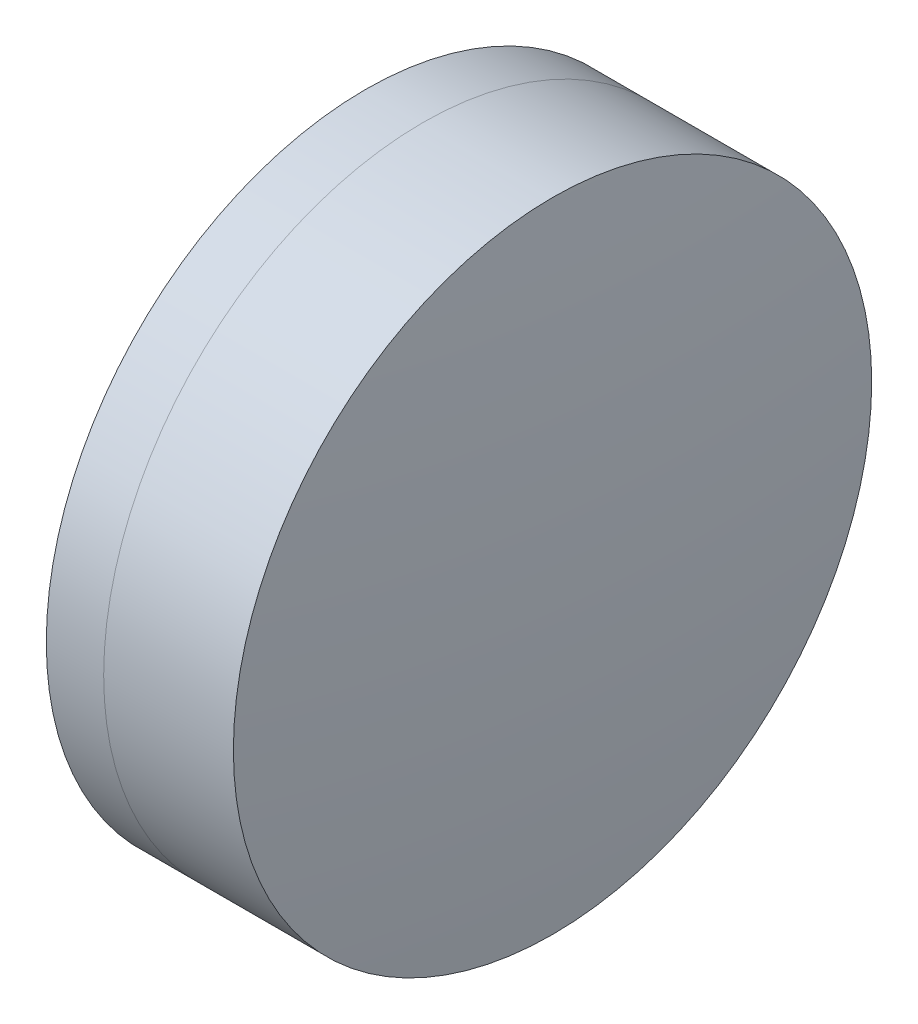
ISO-10303-21;
HEADER;
FILE_DESCRIPTION(('STEP AP214'),'2;1');
FILE_NAME('part.step','',(''),(''),'','','');
FILE_SCHEMA(('AUTOMOTIVE_DESIGN { 1 0 10303 214 1 1 1 1 }'));
ENDSEC;
DATA;
#1=APPLICATION_CONTEXT('core data for automotive mechanical design processes');
#2=APPLICATION_PROTOCOL_DEFINITION('international standard','automotive_design',2000,#1);
#3=PRODUCT_CONTEXT('',#1,'mechanical');
#4=PRODUCT('Part','Part','',(#3));
#5=PRODUCT_RELATED_PRODUCT_CATEGORY('part','',(#4));
#6=PRODUCT_DEFINITION_FORMATION('','',#4);
#7=PRODUCT_DEFINITION_CONTEXT('part definition',#1,'design');
#8=PRODUCT_DEFINITION('design','',#6,#7);
#9=PRODUCT_DEFINITION_SHAPE('','',#8);
#10=(LENGTH_UNIT() NAMED_UNIT(*) SI_UNIT(.MILLI.,.METRE.));
#11=(NAMED_UNIT(*) PLANE_ANGLE_UNIT() SI_UNIT($,.RADIAN.));
#12=(NAMED_UNIT(*) SI_UNIT($,.STERADIAN.) SOLID_ANGLE_UNIT());
#13=UNCERTAINTY_MEASURE_WITH_UNIT(LENGTH_MEASURE(1.E-05),#10,'distance_accuracy_value','');
#14=(GEOMETRIC_REPRESENTATION_CONTEXT(3) GLOBAL_UNCERTAINTY_ASSIGNED_CONTEXT((#13)) GLOBAL_UNIT_ASSIGNED_CONTEXT((#10,
#11,#12)) REPRESENTATION_CONTEXT('',''));
#15=CARTESIAN_POINT('',(0.,0.,0.));
#16=DIRECTION('',(0.,0.,1.));
#17=DIRECTION('',(1.,0.,0.));
#18=AXIS2_PLACEMENT_3D('',#15,#16,#17);
#19=CARTESIAN_POINT('',(269.41091660723,0.,0.));
#20=DIRECTION('',(-1.,0.,0.));
#21=DIRECTION('',(0.,0.,1.));
#22=AXIS2_PLACEMENT_3D('',#19,#20,#21);
#23=SPHERICAL_SURFACE('',#22,41.7);
#24=CARTESIAN_POINT('',(302.482505622577,0.,0.));
#25=DIRECTION('',(-1.,0.,0.));
#26=DIRECTION('',(0.,0.,1.));
#27=AXIS2_PLACEMENT_3D('',#24,#25,#26);
#28=CIRCLE('',#27,25.3999999999999);
#29=CARTESIAN_POINT('',(302.482505622577,0.,25.3999999999999));
#30=VERTEX_POINT('',#29);
#31=EDGE_CURVE('E11',#30,#30,#28,.T.);
#32=ORIENTED_EDGE('',*,*,#31,.T.);
#33=EDGE_LOOP('',(#32));
#34=FACE_BOUND('',#33,.T.);
#35=ADVANCED_FACE('F45',(#34),#23,.F.);
#36=CARTESIAN_POINT('',(-0.551919992657797,0.,0.));
#37=DIRECTION('',(-1.,0.,0.));
#38=DIRECTION('',(0.,0.,1.));
#39=AXIS2_PLACEMENT_3D('',#36,#37,#38);
#40=CYLINDRICAL_SURFACE('',#39,25.3999999999999);
#41=CARTESIAN_POINT('',(312.805173845503,0.,0.));
#42=DIRECTION('',(-1.,0.,0.));
#43=DIRECTION('',(0.,0.,1.));
#44=AXIS2_PLACEMENT_3D('',#41,#42,#43);
#45=CIRCLE('',#44,25.3999999999999);
#46=CARTESIAN_POINT('',(312.805173845503,0.,25.3999999999999));
#47=VERTEX_POINT('',#46);
#48=EDGE_CURVE('E51',#47,#47,#45,.T.);
#49=ORIENTED_EDGE('',*,*,#48,.T.);
#50=EDGE_LOOP('',(#49));
#51=FACE_BOUND('',#50,.T.);
#52=ORIENTED_EDGE('',*,*,#31,.F.);
#53=EDGE_LOOP('',(#52));
#54=FACE_BOUND('',#53,.T.);
#55=ADVANCED_FACE('F57',(#51,#54),#40,.T.);
#56=CARTESIAN_POINT('',(66.4109166072301,0.,0.));
#57=DIRECTION('',(-1.,0.,0.));
#58=DIRECTION('',(0.,0.,1.));
#59=AXIS2_PLACEMENT_3D('',#56,#57,#58);
#60=SPHERICAL_SURFACE('',#59,247.7);
#61=ORIENTED_EDGE('',*,*,#48,.F.);
#62=EDGE_LOOP('',(#61));
#63=FACE_BOUND('',#62,.T.);
#64=ADVANCED_FACE('F60',(#63),#60,.T.);
#65=CLOSED_SHELL('',(#35,#55,#64));
#66=MANIFOLD_SOLID_BREP('B2',#65);
#67=CARTESIAN_POINT('',(341.91091660723,0.,0.));
#68=DIRECTION('',(-1.,0.,0.));
#69=DIRECTION('',(0.,0.,-1.));
#70=AXIS2_PLACEMENT_3D('',#67,#68,#69);
#71=SPHERICAL_SURFACE('',#70,50.8);
#72=CARTESIAN_POINT('',(297.916826094981,0.,0.));
#73=DIRECTION('',(-1.,0.,0.));
#74=DIRECTION('',(0.,0.,1.));
#75=AXIS2_PLACEMENT_3D('',#72,#73,#74);
#76=CIRCLE('',#75,25.4);
#77=CARTESIAN_POINT('',(297.916826094981,0.,25.4));
#78=VERTEX_POINT('',#77);
#79=EDGE_CURVE('E44',#78,#78,#76,.T.);
#80=ORIENTED_EDGE('',*,*,#79,.T.);
#81=EDGE_LOOP('',(#80));
#82=FACE_BOUND('',#81,.T.);
#83=ADVANCED_FACE('F86',(#82),#71,.T.);
#84=CARTESIAN_POINT('',(124.523309526045,0.,0.));
#85=DIRECTION('',(-1.,0.,0.));
#86=DIRECTION('',(0.,0.,1.));
#87=AXIS2_PLACEMENT_3D('',#84,#85,#86);
#88=CYLINDRICAL_SURFACE('',#87,25.4);
#89=CARTESIAN_POINT('',(302.482505622577,0.,0.));
#90=DIRECTION('',(-1.,0.,0.));
#91=DIRECTION('',(0.,0.,1.));
#92=AXIS2_PLACEMENT_3D('',#89,#90,#91);
#93=CIRCLE('',#92,25.4);
#94=CARTESIAN_POINT('',(302.482505622577,0.,25.4));
#95=VERTEX_POINT('',#94);
#96=EDGE_CURVE('E92',#95,#95,#93,.T.);
#97=ORIENTED_EDGE('',*,*,#96,.T.);
#98=EDGE_LOOP('',(#97));
#99=FACE_BOUND('',#98,.T.);
#100=ORIENTED_EDGE('',*,*,#79,.F.);
#101=EDGE_LOOP('',(#100));
#102=FACE_BOUND('',#101,.T.);
#103=ADVANCED_FACE('F98',(#99,#102),#88,.T.);
#104=CARTESIAN_POINT('',(269.41091660723,0.,0.));
#105=DIRECTION('',(-1.,0.,0.));
#106=DIRECTION('',(0.,0.,1.));
#107=AXIS2_PLACEMENT_3D('',#104,#105,#106);
#108=SPHERICAL_SURFACE('',#107,41.7);
#109=ORIENTED_EDGE('',*,*,#96,.F.);
#110=EDGE_LOOP('',(#109));
#111=FACE_BOUND('',#110,.T.);
#112=ADVANCED_FACE('F101',(#111),#108,.T.);
#113=CLOSED_SHELL('',(#83,#103,#112));
#114=MANIFOLD_SOLID_BREP('B6',#113);
#115=ADVANCED_BREP_SHAPE_REPRESENTATION('',(#18,#66,#114),#14);
#116=SHAPE_DEFINITION_REPRESENTATION(#9,#115);
ENDSEC;
END-ISO-10303-21;
